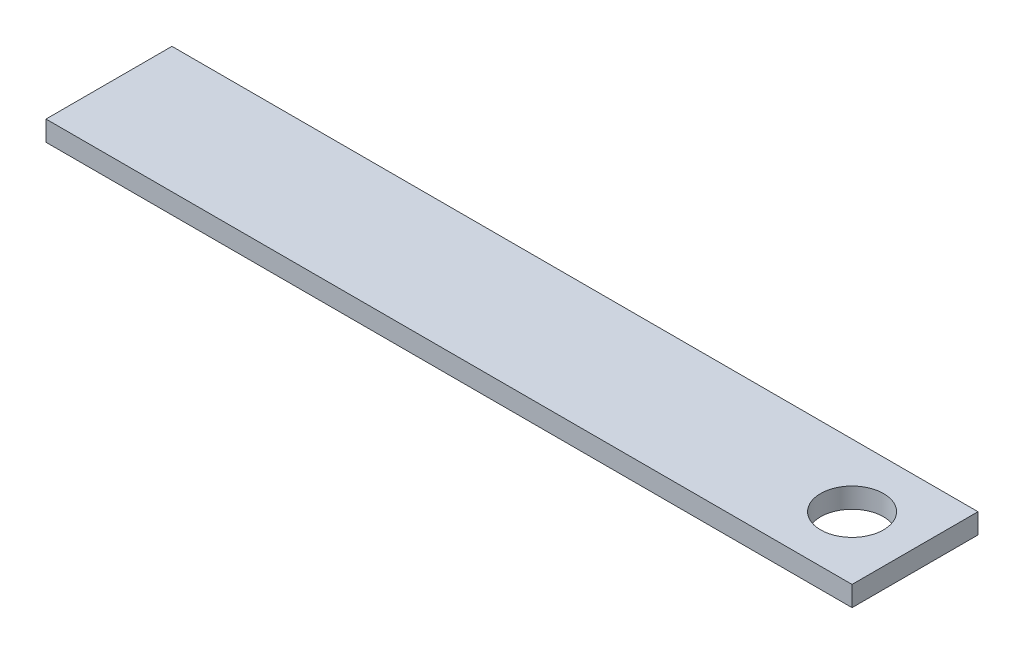
ISO-10303-21;
HEADER;
FILE_DESCRIPTION(('STEP AP214'),'2;1');
FILE_NAME('part.step','',(''),(''),'','','');
FILE_SCHEMA(('AUTOMOTIVE_DESIGN { 1 0 10303 214 1 1 1 1 }'));
ENDSEC;
DATA;
#1=APPLICATION_CONTEXT('core data for automotive mechanical design processes');
#2=APPLICATION_PROTOCOL_DEFINITION('international standard','automotive_design',2000,#1);
#3=PRODUCT_CONTEXT('',#1,'mechanical');
#4=PRODUCT('Part','Part','',(#3));
#5=PRODUCT_RELATED_PRODUCT_CATEGORY('part','',(#4));
#6=PRODUCT_DEFINITION_FORMATION('','',#4);
#7=PRODUCT_DEFINITION_CONTEXT('part definition',#1,'design');
#8=PRODUCT_DEFINITION('design','',#6,#7);
#9=PRODUCT_DEFINITION_SHAPE('','',#8);
#10=(LENGTH_UNIT() NAMED_UNIT(*) SI_UNIT(.MILLI.,.METRE.));
#11=(NAMED_UNIT(*) PLANE_ANGLE_UNIT() SI_UNIT($,.RADIAN.));
#12=(NAMED_UNIT(*) SI_UNIT($,.STERADIAN.) SOLID_ANGLE_UNIT());
#13=UNCERTAINTY_MEASURE_WITH_UNIT(LENGTH_MEASURE(1.E-05),#10,'distance_accuracy_value','');
#14=(GEOMETRIC_REPRESENTATION_CONTEXT(3) GLOBAL_UNCERTAINTY_ASSIGNED_CONTEXT((#13)) GLOBAL_UNIT_ASSIGNED_CONTEXT((#10,
#11,#12)) REPRESENTATION_CONTEXT('',''));
#15=CARTESIAN_POINT('',(0.,0.,0.));
#16=DIRECTION('',(0.,0.,1.));
#17=DIRECTION('',(1.,0.,0.));
#18=AXIS2_PLACEMENT_3D('',#15,#16,#17);
#19=CARTESIAN_POINT('',(80.,4.,0.));
#20=DIRECTION('',(1.,0.,0.));
#21=DIRECTION('',(0.,0.,-1.));
#22=AXIS2_PLACEMENT_3D('',#19,#20,#21);
#23=PLANE('',#22);
#24=DIRECTION('',(0.,0.,1.));
#25=VECTOR('',#24,1.);
#26=CARTESIAN_POINT('',(80.,0.,0.));
#27=LINE('',#26,#25);
#28=CARTESIAN_POINT('',(80.,0.,-12.5));
#29=VERTEX_POINT('',#28);
#30=CARTESIAN_POINT('',(80.,0.,12.5));
#31=VERTEX_POINT('',#30);
#32=EDGE_CURVE('E106',#29,#31,#27,.T.);
#33=ORIENTED_EDGE('',*,*,#32,.F.);
#34=DIRECTION('',(0.,-1.,0.));
#35=VECTOR('',#34,1.);
#36=CARTESIAN_POINT('',(80.,4.,-12.5));
#37=LINE('',#36,#35);
#38=CARTESIAN_POINT('',(80.,4.,-12.5));
#39=VERTEX_POINT('',#38);
#40=EDGE_CURVE('E11',#39,#29,#37,.T.);
#41=ORIENTED_EDGE('',*,*,#40,.F.);
#42=DIRECTION('',(0.,0.,1.));
#43=VECTOR('',#42,1.);
#44=CARTESIAN_POINT('',(80.,4.,0.));
#45=LINE('',#44,#43);
#46=CARTESIAN_POINT('',(80.,4.,12.5));
#47=VERTEX_POINT('',#46);
#48=EDGE_CURVE('E96',#39,#47,#45,.T.);
#49=ORIENTED_EDGE('',*,*,#48,.T.);
#50=DIRECTION('',(0.,-1.,0.));
#51=VECTOR('',#50,1.);
#52=CARTESIAN_POINT('',(80.,4.,12.5));
#53=LINE('',#52,#51);
#54=EDGE_CURVE('E75',#47,#31,#53,.T.);
#55=ORIENTED_EDGE('',*,*,#54,.T.);
#56=EDGE_LOOP('',(#33,#41,#49,#55));
#57=FACE_BOUND('',#56,.T.);
#58=ADVANCED_FACE('F35',(#57),#23,.T.);
#59=CARTESIAN_POINT('',(0.,4.,-12.5));
#60=DIRECTION('',(0.,0.,-1.));
#61=DIRECTION('',(-1.,0.,0.));
#62=AXIS2_PLACEMENT_3D('',#59,#60,#61);
#63=PLANE('',#62);
#64=DIRECTION('',(1.,0.,0.));
#65=VECTOR('',#64,1.);
#66=CARTESIAN_POINT('',(0.,0.,-12.5));
#67=LINE('',#66,#65);
#68=CARTESIAN_POINT('',(-80.,0.,-12.5));
#69=VERTEX_POINT('',#68);
#70=EDGE_CURVE('E87',#69,#29,#67,.T.);
#71=ORIENTED_EDGE('',*,*,#70,.F.);
#72=DIRECTION('',(0.,-1.,0.));
#73=VECTOR('',#72,1.);
#74=CARTESIAN_POINT('',(-80.,4.,-12.5));
#75=LINE('',#74,#73);
#76=CARTESIAN_POINT('',(-80.,4.,-12.5));
#77=VERTEX_POINT('',#76);
#78=EDGE_CURVE('E44',#77,#69,#75,.T.);
#79=ORIENTED_EDGE('',*,*,#78,.F.);
#80=DIRECTION('',(1.,0.,0.));
#81=VECTOR('',#80,1.);
#82=CARTESIAN_POINT('',(0.,4.,-12.5));
#83=LINE('',#82,#81);
#84=EDGE_CURVE('E85',#77,#39,#83,.T.);
#85=ORIENTED_EDGE('',*,*,#84,.T.);
#86=ORIENTED_EDGE('',*,*,#40,.T.);
#87=EDGE_LOOP('',(#71,#79,#85,#86));
#88=FACE_BOUND('',#87,.T.);
#89=ADVANCED_FACE('F83',(#88),#63,.T.);
#90=CARTESIAN_POINT('',(-80.,4.,0.));
#91=DIRECTION('',(1.,0.,0.));
#92=DIRECTION('',(0.,0.,-1.));
#93=AXIS2_PLACEMENT_3D('',#90,#91,#92);
#94=PLANE('',#93);
#95=DIRECTION('',(0.,0.,1.));
#96=VECTOR('',#95,1.);
#97=CARTESIAN_POINT('',(-80.,0.,0.));
#98=LINE('',#97,#96);
#99=CARTESIAN_POINT('',(-80.,0.,12.5));
#100=VERTEX_POINT('',#99);
#101=EDGE_CURVE('E109',#69,#100,#98,.T.);
#102=ORIENTED_EDGE('',*,*,#101,.T.);
#103=DIRECTION('',(0.,-1.,0.));
#104=VECTOR('',#103,1.);
#105=CARTESIAN_POINT('',(-80.,4.,12.5));
#106=LINE('',#105,#104);
#107=CARTESIAN_POINT('',(-80.,4.,12.5));
#108=VERTEX_POINT('',#107);
#109=EDGE_CURVE('E90',#108,#100,#106,.T.);
#110=ORIENTED_EDGE('',*,*,#109,.F.);
#111=DIRECTION('',(0.,0.,1.));
#112=VECTOR('',#111,1.);
#113=CARTESIAN_POINT('',(-80.,4.,0.));
#114=LINE('',#113,#112);
#115=EDGE_CURVE('E92',#77,#108,#114,.T.);
#116=ORIENTED_EDGE('',*,*,#115,.F.);
#117=ORIENTED_EDGE('',*,*,#78,.T.);
#118=EDGE_LOOP('',(#102,#110,#116,#117));
#119=FACE_BOUND('',#118,.T.);
#120=ADVANCED_FACE('F93',(#119),#94,.F.);
#121=CARTESIAN_POINT('',(67.5,4.,0.));
#122=DIRECTION('',(0.,-1.,0.));
#123=DIRECTION('',(0.,0.,-1.));
#124=AXIS2_PLACEMENT_3D('',#121,#122,#123);
#125=CYLINDRICAL_SURFACE('',#124,6.25);
#126=CARTESIAN_POINT('',(67.5,4.,0.));
#127=DIRECTION('',(0.,1.,0.));
#128=DIRECTION('',(0.,0.,1.));
#129=AXIS2_PLACEMENT_3D('',#126,#127,#128);
#130=CIRCLE('',#129,6.25);
#131=CARTESIAN_POINT('',(67.5,4.,6.25));
#132=VERTEX_POINT('',#131);
#133=EDGE_CURVE('E98',#132,#132,#130,.T.);
#134=ORIENTED_EDGE('',*,*,#133,.T.);
#135=EDGE_LOOP('',(#134));
#136=FACE_BOUND('',#135,.T.);
#137=CARTESIAN_POINT('',(67.5,0.,0.));
#138=DIRECTION('',(0.,1.,0.));
#139=DIRECTION('',(0.,0.,1.));
#140=AXIS2_PLACEMENT_3D('',#137,#138,#139);
#141=CIRCLE('',#140,6.25);
#142=CARTESIAN_POINT('',(67.5,0.,6.25));
#143=VERTEX_POINT('',#142);
#144=EDGE_CURVE('E103',#143,#143,#141,.T.);
#145=ORIENTED_EDGE('',*,*,#144,.F.);
#146=EDGE_LOOP('',(#145));
#147=FACE_BOUND('',#146,.T.);
#148=ADVANCED_FACE('F37',(#136,#147),#125,.F.);
#149=CARTESIAN_POINT('',(0.,4.,12.5));
#150=DIRECTION('',(0.,0.,-1.));
#151=DIRECTION('',(-1.,0.,0.));
#152=AXIS2_PLACEMENT_3D('',#149,#150,#151);
#153=PLANE('',#152);
#154=DIRECTION('',(1.,0.,0.));
#155=VECTOR('',#154,1.);
#156=CARTESIAN_POINT('',(0.,0.,12.5));
#157=LINE('',#156,#155);
#158=EDGE_CURVE('E68',#100,#31,#157,.T.);
#159=ORIENTED_EDGE('',*,*,#158,.T.);
#160=ORIENTED_EDGE('',*,*,#54,.F.);
#161=DIRECTION('',(1.,0.,0.));
#162=VECTOR('',#161,1.);
#163=CARTESIAN_POINT('',(0.,4.,12.5));
#164=LINE('',#163,#162);
#165=EDGE_CURVE('E52',#108,#47,#164,.T.);
#166=ORIENTED_EDGE('',*,*,#165,.F.);
#167=ORIENTED_EDGE('',*,*,#109,.T.);
#168=EDGE_LOOP('',(#159,#160,#166,#167));
#169=FACE_BOUND('',#168,.T.);
#170=ADVANCED_FACE('F114',(#169),#153,.F.);
#171=CARTESIAN_POINT('',(0.,4.,0.));
#172=DIRECTION('',(0.,1.,0.));
#173=DIRECTION('',(0.,0.,1.));
#174=AXIS2_PLACEMENT_3D('',#171,#172,#173);
#175=PLANE('',#174);
#176=ORIENTED_EDGE('',*,*,#133,.F.);
#177=EDGE_LOOP('',(#176));
#178=FACE_BOUND('',#177,.T.);
#179=ORIENTED_EDGE('',*,*,#48,.F.);
#180=ORIENTED_EDGE('',*,*,#84,.F.);
#181=ORIENTED_EDGE('',*,*,#115,.T.);
#182=ORIENTED_EDGE('',*,*,#165,.T.);
#183=EDGE_LOOP('',(#179,#180,#181,#182));
#184=FACE_BOUND('',#183,.T.);
#185=ADVANCED_FACE('F95',(#178,#184),#175,.T.);
#186=CARTESIAN_POINT('',(0.,0.,0.));
#187=DIRECTION('',(0.,1.,0.));
#188=DIRECTION('',(0.,0.,1.));
#189=AXIS2_PLACEMENT_3D('',#186,#187,#188);
#190=PLANE('',#189);
#191=ORIENTED_EDGE('',*,*,#144,.T.);
#192=EDGE_LOOP('',(#191));
#193=FACE_BOUND('',#192,.T.);
#194=ORIENTED_EDGE('',*,*,#32,.T.);
#195=ORIENTED_EDGE('',*,*,#158,.F.);
#196=ORIENTED_EDGE('',*,*,#101,.F.);
#197=ORIENTED_EDGE('',*,*,#70,.T.);
#198=EDGE_LOOP('',(#194,#195,#196,#197));
#199=FACE_BOUND('',#198,.T.);
#200=ADVANCED_FACE('F115',(#193,#199),#190,.F.);
#201=CLOSED_SHELL('',(#58,#89,#120,#148,#170,#185,#200));
#202=MANIFOLD_SOLID_BREP('B2',#201);
#203=ADVANCED_BREP_SHAPE_REPRESENTATION('',(#18,#202),#14);
#204=SHAPE_DEFINITION_REPRESENTATION(#9,#203);
ENDSEC;
END-ISO-10303-21;
